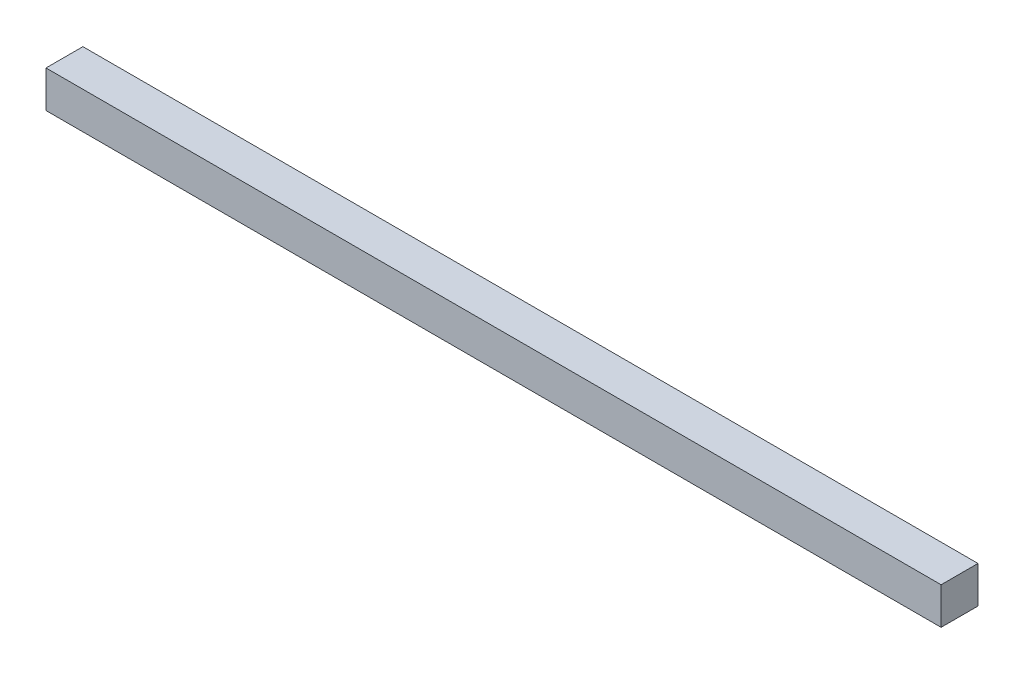
ISO-10303-21;
HEADER;
FILE_DESCRIPTION(('STEP AP214'),'2;1');
FILE_NAME('part.step','',(''),(''),'','','');
FILE_SCHEMA(('AUTOMOTIVE_DESIGN { 1 0 10303 214 1 1 1 1 }'));
ENDSEC;
DATA;
#1=APPLICATION_CONTEXT('core data for automotive mechanical design processes');
#2=APPLICATION_PROTOCOL_DEFINITION('international standard','automotive_design',2000,#1);
#3=PRODUCT_CONTEXT('',#1,'mechanical');
#4=PRODUCT('Part','Part','',(#3));
#5=PRODUCT_RELATED_PRODUCT_CATEGORY('part','',(#4));
#6=PRODUCT_DEFINITION_FORMATION('','',#4);
#7=PRODUCT_DEFINITION_CONTEXT('part definition',#1,'design');
#8=PRODUCT_DEFINITION('design','',#6,#7);
#9=PRODUCT_DEFINITION_SHAPE('','',#8);
#10=(LENGTH_UNIT() NAMED_UNIT(*) SI_UNIT(.MILLI.,.METRE.));
#11=(NAMED_UNIT(*) PLANE_ANGLE_UNIT() SI_UNIT($,.RADIAN.));
#12=(NAMED_UNIT(*) SI_UNIT($,.STERADIAN.) SOLID_ANGLE_UNIT());
#13=UNCERTAINTY_MEASURE_WITH_UNIT(LENGTH_MEASURE(1.E-05),#10,'distance_accuracy_value','');
#14=(GEOMETRIC_REPRESENTATION_CONTEXT(3) GLOBAL_UNCERTAINTY_ASSIGNED_CONTEXT((#13)) GLOBAL_UNIT_ASSIGNED_CONTEXT((#10,
#11,#12)) REPRESENTATION_CONTEXT('',''));
#15=CARTESIAN_POINT('',(0.,0.,0.));
#16=DIRECTION('',(0.,0.,1.));
#17=DIRECTION('',(1.,0.,0.));
#18=AXIS2_PLACEMENT_3D('',#15,#16,#17);
#19=CARTESIAN_POINT('',(231.07,19.05,-9.525));
#20=DIRECTION('',(-1.,0.,0.));
#21=DIRECTION('',(0.,0.,1.));
#22=AXIS2_PLACEMENT_3D('',#19,#20,#21);
#23=PLANE('',#22);
#24=DIRECTION('',(0.,0.,-1.));
#25=VECTOR('',#24,1.);
#26=CARTESIAN_POINT('',(231.07,0.,-9.525));
#27=LINE('',#26,#25);
#28=CARTESIAN_POINT('',(231.07,0.,9.52500000000001));
#29=VERTEX_POINT('',#28);
#30=CARTESIAN_POINT('',(231.07,0.,-9.525));
#31=VERTEX_POINT('',#30);
#32=EDGE_CURVE('E96',#29,#31,#27,.T.);
#33=ORIENTED_EDGE('',*,*,#32,.T.);
#34=DIRECTION('',(0.,-1.,0.));
#35=VECTOR('',#34,1.);
#36=CARTESIAN_POINT('',(231.07,19.05,-9.525));
#37=LINE('',#36,#35);
#38=CARTESIAN_POINT('',(231.07,19.05,-9.525));
#39=VERTEX_POINT('',#38);
#40=EDGE_CURVE('E11',#39,#31,#37,.T.);
#41=ORIENTED_EDGE('',*,*,#40,.F.);
#42=DIRECTION('',(0.,0.,-1.));
#43=VECTOR('',#42,1.);
#44=CARTESIAN_POINT('',(231.07,19.05,-9.525));
#45=LINE('',#44,#43);
#46=CARTESIAN_POINT('',(231.07,19.05,9.52500000000001));
#47=VERTEX_POINT('',#46);
#48=EDGE_CURVE('E84',#47,#39,#45,.T.);
#49=ORIENTED_EDGE('',*,*,#48,.F.);
#50=DIRECTION('',(0.,-1.,0.));
#51=VECTOR('',#50,1.);
#52=CARTESIAN_POINT('',(231.07,19.05,9.52500000000001));
#53=LINE('',#52,#51);
#54=EDGE_CURVE('E92',#47,#29,#53,.T.);
#55=ORIENTED_EDGE('',*,*,#54,.T.);
#56=EDGE_LOOP('',(#33,#41,#49,#55));
#57=FACE_BOUND('',#56,.T.);
#58=ADVANCED_FACE('F33',(#57),#23,.F.);
#59=CARTESIAN_POINT('',(-231.07,19.05,-9.525));
#60=DIRECTION('',(0.,0.,1.));
#61=DIRECTION('',(1.,0.,0.));
#62=AXIS2_PLACEMENT_3D('',#59,#60,#61);
#63=PLANE('',#62);
#64=DIRECTION('',(-1.,0.,0.));
#65=VECTOR('',#64,1.);
#66=CARTESIAN_POINT('',(-231.07,0.,-9.525));
#67=LINE('',#66,#65);
#68=CARTESIAN_POINT('',(-231.07,0.,-9.525));
#69=VERTEX_POINT('',#68);
#70=EDGE_CURVE('E88',#31,#69,#67,.T.);
#71=ORIENTED_EDGE('',*,*,#70,.T.);
#72=DIRECTION('',(0.,-1.,0.));
#73=VECTOR('',#72,1.);
#74=CARTESIAN_POINT('',(-231.07,19.05,-9.525));
#75=LINE('',#74,#73);
#76=CARTESIAN_POINT('',(-231.07,19.05,-9.525));
#77=VERTEX_POINT('',#76);
#78=EDGE_CURVE('E41',#77,#69,#75,.T.);
#79=ORIENTED_EDGE('',*,*,#78,.F.);
#80=DIRECTION('',(-1.,0.,0.));
#81=VECTOR('',#80,1.);
#82=CARTESIAN_POINT('',(-231.07,19.05,-9.525));
#83=LINE('',#82,#81);
#84=EDGE_CURVE('E79',#39,#77,#83,.T.);
#85=ORIENTED_EDGE('',*,*,#84,.F.);
#86=ORIENTED_EDGE('',*,*,#40,.T.);
#87=EDGE_LOOP('',(#71,#79,#85,#86));
#88=FACE_BOUND('',#87,.T.);
#89=ADVANCED_FACE('F87',(#88),#63,.F.);
#90=CARTESIAN_POINT('',(-231.07,19.05,-9.525));
#91=DIRECTION('',(1.,0.,0.));
#92=DIRECTION('',(0.,0.,-1.));
#93=AXIS2_PLACEMENT_3D('',#90,#91,#92);
#94=PLANE('',#93);
#95=DIRECTION('',(0.,0.,1.));
#96=VECTOR('',#95,1.);
#97=CARTESIAN_POINT('',(-231.07,0.,-9.525));
#98=LINE('',#97,#96);
#99=CARTESIAN_POINT('',(-231.07,0.,9.52500000000001));
#100=VERTEX_POINT('',#99);
#101=EDGE_CURVE('E66',#69,#100,#98,.T.);
#102=ORIENTED_EDGE('',*,*,#101,.T.);
#103=DIRECTION('',(0.,-1.,0.));
#104=VECTOR('',#103,1.);
#105=CARTESIAN_POINT('',(-231.07,19.05,9.52500000000001));
#106=LINE('',#105,#104);
#107=CARTESIAN_POINT('',(-231.07,19.05,9.52500000000001));
#108=VERTEX_POINT('',#107);
#109=EDGE_CURVE('E89',#108,#100,#106,.T.);
#110=ORIENTED_EDGE('',*,*,#109,.F.);
#111=DIRECTION('',(0.,0.,1.));
#112=VECTOR('',#111,1.);
#113=CARTESIAN_POINT('',(-231.07,19.05,-9.525));
#114=LINE('',#113,#112);
#115=EDGE_CURVE('E82',#77,#108,#114,.T.);
#116=ORIENTED_EDGE('',*,*,#115,.F.);
#117=ORIENTED_EDGE('',*,*,#78,.T.);
#118=EDGE_LOOP('',(#102,#110,#116,#117));
#119=FACE_BOUND('',#118,.T.);
#120=ADVANCED_FACE('F90',(#119),#94,.F.);
#121=CARTESIAN_POINT('',(-231.07,19.05,9.52500000000001));
#122=DIRECTION('',(0.,0.,-1.));
#123=DIRECTION('',(-1.,0.,0.));
#124=AXIS2_PLACEMENT_3D('',#121,#122,#123);
#125=PLANE('',#124);
#126=DIRECTION('',(1.,0.,0.));
#127=VECTOR('',#126,1.);
#128=CARTESIAN_POINT('',(-231.07,0.,9.52500000000001));
#129=LINE('',#128,#127);
#130=EDGE_CURVE('E72',#100,#29,#129,.T.);
#131=ORIENTED_EDGE('',*,*,#130,.T.);
#132=ORIENTED_EDGE('',*,*,#54,.F.);
#133=DIRECTION('',(1.,0.,0.));
#134=VECTOR('',#133,1.);
#135=CARTESIAN_POINT('',(-231.07,19.05,9.52500000000001));
#136=LINE('',#135,#134);
#137=EDGE_CURVE('E49',#108,#47,#136,.T.);
#138=ORIENTED_EDGE('',*,*,#137,.F.);
#139=ORIENTED_EDGE('',*,*,#109,.T.);
#140=EDGE_LOOP('',(#131,#132,#138,#139));
#141=FACE_BOUND('',#140,.T.);
#142=ADVANCED_FACE('F103',(#141),#125,.F.);
#143=CARTESIAN_POINT('',(0.,19.05,0.));
#144=DIRECTION('',(0.,1.,0.));
#145=DIRECTION('',(0.,0.,1.));
#146=AXIS2_PLACEMENT_3D('',#143,#144,#145);
#147=PLANE('',#146);
#148=ORIENTED_EDGE('',*,*,#48,.T.);
#149=ORIENTED_EDGE('',*,*,#84,.T.);
#150=ORIENTED_EDGE('',*,*,#115,.T.);
#151=ORIENTED_EDGE('',*,*,#137,.T.);
#152=EDGE_LOOP('',(#148,#149,#150,#151));
#153=FACE_BOUND('',#152,.T.);
#154=ADVANCED_FACE('F80',(#153),#147,.T.);
#155=CARTESIAN_POINT('',(0.,0.,0.));
#156=DIRECTION('',(0.,1.,0.));
#157=DIRECTION('',(0.,0.,1.));
#158=AXIS2_PLACEMENT_3D('',#155,#156,#157);
#159=PLANE('',#158);
#160=ORIENTED_EDGE('',*,*,#32,.F.);
#161=ORIENTED_EDGE('',*,*,#130,.F.);
#162=ORIENTED_EDGE('',*,*,#101,.F.);
#163=ORIENTED_EDGE('',*,*,#70,.F.);
#164=EDGE_LOOP('',(#160,#161,#162,#163));
#165=FACE_BOUND('',#164,.T.);
#166=ADVANCED_FACE('F106',(#165),#159,.F.);
#167=CLOSED_SHELL('',(#58,#89,#120,#142,#154,#166));
#168=MANIFOLD_SOLID_BREP('B2',#167);
#169=ADVANCED_BREP_SHAPE_REPRESENTATION('',(#18,#168),#14);
#170=SHAPE_DEFINITION_REPRESENTATION(#9,#169);
ENDSEC;
END-ISO-10303-21;
